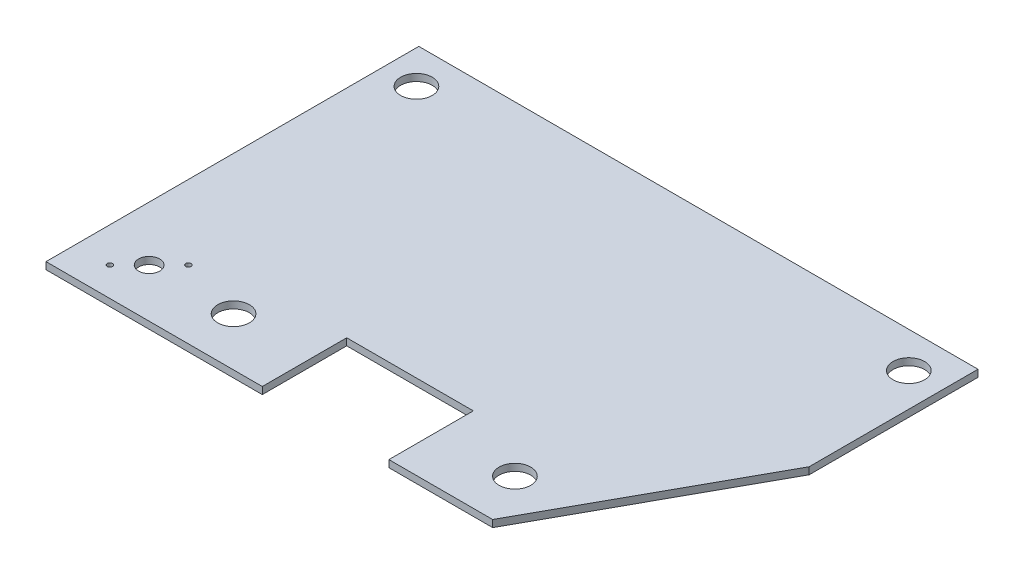
ISO-10303-21;
HEADER;
FILE_DESCRIPTION(('STEP AP214'),'2;1');
FILE_NAME('part.step','',(''),(''),'','','');
FILE_SCHEMA(('AUTOMOTIVE_DESIGN { 1 0 10303 214 1 1 1 1 }'));
ENDSEC;
DATA;
#1=APPLICATION_CONTEXT('core data for automotive mechanical design processes');
#2=APPLICATION_PROTOCOL_DEFINITION('international standard','automotive_design',2000,#1);
#3=PRODUCT_CONTEXT('',#1,'mechanical');
#4=PRODUCT('Part','Part','',(#3));
#5=PRODUCT_RELATED_PRODUCT_CATEGORY('part','',(#4));
#6=PRODUCT_DEFINITION_FORMATION('','',#4);
#7=PRODUCT_DEFINITION_CONTEXT('part definition',#1,'design');
#8=PRODUCT_DEFINITION('design','',#6,#7);
#9=PRODUCT_DEFINITION_SHAPE('','',#8);
#10=(LENGTH_UNIT() NAMED_UNIT(*) SI_UNIT(.MILLI.,.METRE.));
#11=(NAMED_UNIT(*) PLANE_ANGLE_UNIT() SI_UNIT($,.RADIAN.));
#12=(NAMED_UNIT(*) SI_UNIT($,.STERADIAN.) SOLID_ANGLE_UNIT());
#13=UNCERTAINTY_MEASURE_WITH_UNIT(LENGTH_MEASURE(1.E-05),#10,'distance_accuracy_value','');
#14=(GEOMETRIC_REPRESENTATION_CONTEXT(3) GLOBAL_UNCERTAINTY_ASSIGNED_CONTEXT((#13)) GLOBAL_UNIT_ASSIGNED_CONTEXT((#10,
#11,#12)) REPRESENTATION_CONTEXT('',''));
#15=CARTESIAN_POINT('',(0.,0.,0.));
#16=DIRECTION('',(0.,0.,1.));
#17=DIRECTION('',(1.,0.,0.));
#18=AXIS2_PLACEMENT_3D('',#15,#16,#17);
#19=CARTESIAN_POINT('',(-252.4125,3.175,168.275));
#20=DIRECTION('',(0.,0.,-1.));
#21=DIRECTION('',(-1.,0.,0.));
#22=AXIS2_PLACEMENT_3D('',#19,#20,#21);
#23=PLANE('',#22);
#24=DIRECTION('',(1.,0.,0.));
#25=VECTOR('',#24,1.);
#26=CARTESIAN_POINT('',(-252.4125,-3.175,168.275));
#27=LINE('',#26,#25);
#28=CARTESIAN_POINT('',(-252.4125,-3.175,168.275));
#29=VERTEX_POINT('',#28);
#30=CARTESIAN_POINT('',(-57.15,-3.175,168.275));
#31=VERTEX_POINT('',#30);
#32=EDGE_CURVE('E200',#29,#31,#27,.T.);
#33=ORIENTED_EDGE('',*,*,#32,.T.);
#34=DIRECTION('',(0.,1.,0.));
#35=VECTOR('',#34,1.);
#36=CARTESIAN_POINT('',(-57.15,-3.175,168.275));
#37=LINE('',#36,#35);
#38=CARTESIAN_POINT('',(-57.15,3.175,168.275));
#39=VERTEX_POINT('',#38);
#40=EDGE_CURVE('E113',#31,#39,#37,.T.);
#41=ORIENTED_EDGE('',*,*,#40,.T.);
#42=DIRECTION('',(1.,0.,0.));
#43=VECTOR('',#42,1.);
#44=CARTESIAN_POINT('',(-252.4125,3.175,168.275));
#45=LINE('',#44,#43);
#46=CARTESIAN_POINT('',(-252.4125,3.175,168.275));
#47=VERTEX_POINT('',#46);
#48=EDGE_CURVE('E108',#47,#39,#45,.T.);
#49=ORIENTED_EDGE('',*,*,#48,.F.);
#50=DIRECTION('',(0.,-1.,0.));
#51=VECTOR('',#50,1.);
#52=CARTESIAN_POINT('',(-252.4125,3.175,168.275));
#53=LINE('',#52,#51);
#54=EDGE_CURVE('E112',#47,#29,#53,.T.);
#55=ORIENTED_EDGE('',*,*,#54,.T.);
#56=EDGE_LOOP('',(#33,#41,#49,#55));
#57=FACE_BOUND('',#56,.T.);
#58=ADVANCED_FACE('F34',(#57),#23,.F.);
#59=CARTESIAN_POINT('',(252.4125,3.175,168.275));
#60=DIRECTION('',(-1.,0.,0.));
#61=DIRECTION('',(0.,0.,1.));
#62=AXIS2_PLACEMENT_3D('',#59,#60,#61);
#63=PLANE('',#62);
#64=DIRECTION('',(0.,0.,-1.));
#65=VECTOR('',#64,1.);
#66=CARTESIAN_POINT('',(252.4125,3.175,168.275));
#67=LINE('',#66,#65);
#68=CARTESIAN_POINT('',(252.4125,3.175,-15.875));
#69=VERTEX_POINT('',#68);
#70=CARTESIAN_POINT('',(252.4125,3.175,-168.275));
#71=VERTEX_POINT('',#70);
#72=EDGE_CURVE('E198',#69,#71,#67,.T.);
#73=ORIENTED_EDGE('',*,*,#72,.F.);
#74=DIRECTION('',(0.,-1.,0.));
#75=VECTOR('',#74,1.);
#76=CARTESIAN_POINT('',(252.4125,3.175,-15.875));
#77=LINE('',#76,#75);
#78=CARTESIAN_POINT('',(252.4125,-3.175,-15.875));
#79=VERTEX_POINT('',#78);
#80=EDGE_CURVE('E169',#69,#79,#77,.T.);
#81=ORIENTED_EDGE('',*,*,#80,.T.);
#82=DIRECTION('',(0.,0.,-1.));
#83=VECTOR('',#82,1.);
#84=CARTESIAN_POINT('',(252.4125,-3.175,168.275));
#85=LINE('',#84,#83);
#86=CARTESIAN_POINT('',(252.4125,-3.175,-168.275));
#87=VERTEX_POINT('',#86);
#88=EDGE_CURVE('E177',#79,#87,#85,.T.);
#89=ORIENTED_EDGE('',*,*,#88,.T.);
#90=DIRECTION('',(0.,-1.,0.));
#91=VECTOR('',#90,1.);
#92=CARTESIAN_POINT('',(252.4125,3.175,-168.275));
#93=LINE('',#92,#91);
#94=EDGE_CURVE('E11',#71,#87,#93,.T.);
#95=ORIENTED_EDGE('',*,*,#94,.F.);
#96=EDGE_LOOP('',(#73,#81,#89,#95));
#97=FACE_BOUND('',#96,.T.);
#98=ADVANCED_FACE('F36',(#97),#63,.F.);
#99=CARTESIAN_POINT('',(-252.4125,3.175,-168.275));
#100=DIRECTION('',(0.,0.,1.));
#101=DIRECTION('',(1.,0.,0.));
#102=AXIS2_PLACEMENT_3D('',#99,#100,#101);
#103=PLANE('',#102);
#104=DIRECTION('',(-1.,0.,0.));
#105=VECTOR('',#104,1.);
#106=CARTESIAN_POINT('',(-252.4125,-3.175,-168.275));
#107=LINE('',#106,#105);
#108=CARTESIAN_POINT('',(-252.4125,-3.175,-168.275));
#109=VERTEX_POINT('',#108);
#110=EDGE_CURVE('E203',#87,#109,#107,.T.);
#111=ORIENTED_EDGE('',*,*,#110,.T.);
#112=DIRECTION('',(0.,-1.,0.));
#113=VECTOR('',#112,1.);
#114=CARTESIAN_POINT('',(-252.4125,3.175,-168.275));
#115=LINE('',#114,#113);
#116=CARTESIAN_POINT('',(-252.4125,3.175,-168.275));
#117=VERTEX_POINT('',#116);
#118=EDGE_CURVE('E42',#117,#109,#115,.T.);
#119=ORIENTED_EDGE('',*,*,#118,.F.);
#120=DIRECTION('',(-1.,0.,0.));
#121=VECTOR('',#120,1.);
#122=CARTESIAN_POINT('',(-252.4125,3.175,-168.275));
#123=LINE('',#122,#121);
#124=EDGE_CURVE('E123',#71,#117,#123,.T.);
#125=ORIENTED_EDGE('',*,*,#124,.F.);
#126=ORIENTED_EDGE('',*,*,#94,.T.);
#127=EDGE_LOOP('',(#111,#119,#125,#126));
#128=FACE_BOUND('',#127,.T.);
#129=ADVANCED_FACE('F229',(#128),#103,.F.);
#130=CARTESIAN_POINT('',(-252.4125,3.175,168.275));
#131=DIRECTION('',(1.,0.,0.));
#132=DIRECTION('',(0.,0.,-1.));
#133=AXIS2_PLACEMENT_3D('',#130,#131,#132);
#134=PLANE('',#133);
#135=DIRECTION('',(0.,0.,1.));
#136=VECTOR('',#135,1.);
#137=CARTESIAN_POINT('',(-252.4125,-3.175,168.275));
#138=LINE('',#137,#136);
#139=EDGE_CURVE('E131',#109,#29,#138,.T.);
#140=ORIENTED_EDGE('',*,*,#139,.T.);
#141=ORIENTED_EDGE('',*,*,#54,.F.);
#142=DIRECTION('',(0.,0.,1.));
#143=VECTOR('',#142,1.);
#144=CARTESIAN_POINT('',(-252.4125,3.175,168.275));
#145=LINE('',#144,#143);
#146=EDGE_CURVE('E119',#117,#47,#145,.T.);
#147=ORIENTED_EDGE('',*,*,#146,.F.);
#148=ORIENTED_EDGE('',*,*,#118,.T.);
#149=EDGE_LOOP('',(#140,#141,#147,#148));
#150=FACE_BOUND('',#149,.T.);
#151=ADVANCED_FACE('F129',(#150),#134,.F.);
#152=CARTESIAN_POINT('',(57.15,3.175,168.275));
#153=VERTEX_POINT('',#152);
#154=CARTESIAN_POINT('',(150.8125,3.175,168.275));
#155=VERTEX_POINT('',#154);
#156=EDGE_CURVE('E116',#153,#155,#45,.T.);
#157=ORIENTED_EDGE('',*,*,#156,.F.);
#158=DIRECTION('',(0.,1.,0.));
#159=VECTOR('',#158,1.);
#160=CARTESIAN_POINT('',(57.15,-3.175,168.275));
#161=LINE('',#160,#159);
#162=CARTESIAN_POINT('',(57.15,-3.175,168.275));
#163=VERTEX_POINT('',#162);
#164=EDGE_CURVE('E161',#163,#153,#161,.T.);
#165=ORIENTED_EDGE('',*,*,#164,.F.);
#166=CARTESIAN_POINT('',(150.8125,-3.175,168.275));
#167=VERTEX_POINT('',#166);
#168=EDGE_CURVE('E57',#163,#167,#27,.T.);
#169=ORIENTED_EDGE('',*,*,#168,.T.);
#170=DIRECTION('',(0.,-1.,0.));
#171=VECTOR('',#170,1.);
#172=CARTESIAN_POINT('',(150.8125,3.175,168.275));
#173=LINE('',#172,#171);
#174=EDGE_CURVE('E167',#155,#167,#173,.T.);
#175=ORIENTED_EDGE('',*,*,#174,.F.);
#176=EDGE_LOOP('',(#157,#165,#169,#175));
#177=FACE_BOUND('',#176,.T.);
#178=ADVANCED_FACE('F221',(#177),#23,.F.);
#179=CARTESIAN_POINT('',(0.,3.175,0.));
#180=DIRECTION('',(0.,-1.,0.));
#181=DIRECTION('',(0.,0.,-1.));
#182=AXIS2_PLACEMENT_3D('',#179,#180,#181);
#183=PLANE('',#182);
#184=CARTESIAN_POINT('',(-185.4708,3.175,106.645513664432));
#185=DIRECTION('',(0.,1.,0.));
#186=DIRECTION('',(0.,0.,1.));
#187=AXIS2_PLACEMENT_3D('',#184,#185,#186);
#188=CIRCLE('',#187,2.41299999999999);
#189=CARTESIAN_POINT('',(-185.4708,3.175,109.058513664432));
#190=VERTEX_POINT('',#189);
#191=EDGE_CURVE('E296',#190,#190,#188,.T.);
#192=ORIENTED_EDGE('',*,*,#191,.F.);
#193=EDGE_LOOP('',(#192));
#194=FACE_BOUND('',#193,.T.);
#195=CARTESIAN_POINT('',(-222.25,3.175,-135.975286335568));
#196=DIRECTION('',(0.,1.,0.));
#197=DIRECTION('',(0.,0.,1.));
#198=AXIS2_PLACEMENT_3D('',#195,#196,#197);
#199=CIRCLE('',#198,14.2748);
#200=CARTESIAN_POINT('',(-222.25,3.175,-121.700486335568));
#201=VERTEX_POINT('',#200);
#202=EDGE_CURVE('E178',#201,#201,#199,.T.);
#203=ORIENTED_EDGE('',*,*,#202,.F.);
#204=EDGE_LOOP('',(#203));
#205=FACE_BOUND('',#204,.T.);
#206=CARTESIAN_POINT('',(127.,3.175,124.374713664432));
#207=DIRECTION('',(0.,1.,0.));
#208=DIRECTION('',(0.,0.,1.));
#209=AXIS2_PLACEMENT_3D('',#206,#207,#208);
#210=CIRCLE('',#209,14.2748);
#211=CARTESIAN_POINT('',(127.,3.175,138.649513664432));
#212=VERTEX_POINT('',#211);
#213=EDGE_CURVE('E172',#212,#212,#210,.T.);
#214=ORIENTED_EDGE('',*,*,#213,.F.);
#215=EDGE_LOOP('',(#214));
#216=FACE_BOUND('',#215,.T.);
#217=CARTESIAN_POINT('',(-127.,3.175,124.374713664432));
#218=DIRECTION('',(0.,1.,0.));
#219=DIRECTION('',(0.,0.,1.));
#220=AXIS2_PLACEMENT_3D('',#217,#218,#219);
#221=CIRCLE('',#220,14.2748);
#222=CARTESIAN_POINT('',(-127.,3.175,138.649513664432));
#223=VERTEX_POINT('',#222);
#224=EDGE_CURVE('E185',#223,#223,#221,.T.);
#225=ORIENTED_EDGE('',*,*,#224,.F.);
#226=EDGE_LOOP('',(#225));
#227=FACE_BOUND('',#226,.T.);
#228=CARTESIAN_POINT('',(222.25,3.175,-135.975286335568));
#229=DIRECTION('',(0.,1.,0.));
#230=DIRECTION('',(0.,0.,1.));
#231=AXIS2_PLACEMENT_3D('',#228,#229,#230);
#232=CIRCLE('',#231,14.2748000000001);
#233=CARTESIAN_POINT('',(222.25,3.175,-121.700486335568));
#234=VERTEX_POINT('',#233);
#235=EDGE_CURVE('E190',#234,#234,#232,.T.);
#236=ORIENTED_EDGE('',*,*,#235,.F.);
#237=EDGE_LOOP('',(#236));
#238=FACE_BOUND('',#237,.T.);
#239=ORIENTED_EDGE('',*,*,#48,.T.);
#240=DIRECTION('',(0.,0.,1.));
#241=VECTOR('',#240,1.);
#242=CARTESIAN_POINT('',(-57.15,3.175,168.275));
#243=LINE('',#242,#241);
#244=CARTESIAN_POINT('',(-57.15,3.175,92.075));
#245=VERTEX_POINT('',#244);
#246=EDGE_CURVE('E132',#245,#39,#243,.T.);
#247=ORIENTED_EDGE('',*,*,#246,.F.);
#248=DIRECTION('',(-1.,0.,0.));
#249=VECTOR('',#248,1.);
#250=CARTESIAN_POINT('',(-57.15,3.175,92.075));
#251=LINE('',#250,#249);
#252=CARTESIAN_POINT('',(57.15,3.175,92.075));
#253=VERTEX_POINT('',#252);
#254=EDGE_CURVE('E148',#253,#245,#251,.T.);
#255=ORIENTED_EDGE('',*,*,#254,.F.);
#256=DIRECTION('',(0.,0.,-1.));
#257=VECTOR('',#256,1.);
#258=CARTESIAN_POINT('',(57.15,3.175,168.275));
#259=LINE('',#258,#257);
#260=EDGE_CURVE('E135',#153,#253,#259,.T.);
#261=ORIENTED_EDGE('',*,*,#260,.F.);
#262=ORIENTED_EDGE('',*,*,#156,.T.);
#263=DIRECTION('',(0.483077342911335,0.,-0.875577684026794));
#264=VECTOR('',#263,1.);
#265=CARTESIAN_POINT('',(252.4125,3.175,-15.875));
#266=LINE('',#265,#264);
#267=EDGE_CURVE('E164',#155,#69,#266,.T.);
#268=ORIENTED_EDGE('',*,*,#267,.T.);
#269=ORIENTED_EDGE('',*,*,#72,.T.);
#270=ORIENTED_EDGE('',*,*,#124,.T.);
#271=ORIENTED_EDGE('',*,*,#146,.T.);
#272=EDGE_LOOP('',(#239,#247,#255,#261,#262,#268,#269,#270,#271));
#273=FACE_BOUND('',#272,.T.);
#274=CARTESIAN_POINT('',(-220.9292,3.175,142.103913664432));
#275=DIRECTION('',(0.,1.,0.));
#276=DIRECTION('',(0.,0.,1.));
#277=AXIS2_PLACEMENT_3D('',#274,#275,#276);
#278=CIRCLE('',#277,2.413);
#279=CARTESIAN_POINT('',(-220.9292,3.175,144.516913664432));
#280=VERTEX_POINT('',#279);
#281=EDGE_CURVE('E138',#280,#280,#278,.T.);
#282=ORIENTED_EDGE('',*,*,#281,.F.);
#283=EDGE_LOOP('',(#282));
#284=FACE_BOUND('',#283,.T.);
#285=CARTESIAN_POINT('',(-203.2,3.175,124.374713664432));
#286=DIRECTION('',(0.,1.,0.));
#287=DIRECTION('',(0.,0.,1.));
#288=AXIS2_PLACEMENT_3D('',#285,#286,#287);
#289=CIRCLE('',#288,9.525);
#290=CARTESIAN_POINT('',(-203.2,3.175,133.899713664432));
#291=VERTEX_POINT('',#290);
#292=EDGE_CURVE('E133',#291,#291,#289,.T.);
#293=ORIENTED_EDGE('',*,*,#292,.F.);
#294=EDGE_LOOP('',(#293));
#295=FACE_BOUND('',#294,.T.);
#296=ADVANCED_FACE('F120',(#194,#205,#216,#227,#238,#273,#284,#295),#183,.F.);
#297=CARTESIAN_POINT('',(0.,-3.175,0.));
#298=DIRECTION('',(0.,-1.,0.));
#299=DIRECTION('',(0.,0.,-1.));
#300=AXIS2_PLACEMENT_3D('',#297,#298,#299);
#301=PLANE('',#300);
#302=CARTESIAN_POINT('',(-185.4708,-3.175,106.645513664432));
#303=DIRECTION('',(0.,1.,0.));
#304=DIRECTION('',(0.,0.,1.));
#305=AXIS2_PLACEMENT_3D('',#302,#303,#304);
#306=CIRCLE('',#305,2.41299999999999);
#307=CARTESIAN_POINT('',(-185.4708,-3.175,109.058513664432));
#308=VERTEX_POINT('',#307);
#309=EDGE_CURVE('E294',#308,#308,#306,.T.);
#310=ORIENTED_EDGE('',*,*,#309,.T.);
#311=EDGE_LOOP('',(#310));
#312=FACE_BOUND('',#311,.T.);
#313=DIRECTION('',(0.,0.,1.));
#314=VECTOR('',#313,1.);
#315=CARTESIAN_POINT('',(-57.15,-3.175,168.275));
#316=LINE('',#315,#314);
#317=CARTESIAN_POINT('',(-57.15,-3.175,92.075));
#318=VERTEX_POINT('',#317);
#319=EDGE_CURVE('E144',#318,#31,#316,.T.);
#320=ORIENTED_EDGE('',*,*,#319,.T.);
#321=ORIENTED_EDGE('',*,*,#32,.F.);
#322=ORIENTED_EDGE('',*,*,#139,.F.);
#323=ORIENTED_EDGE('',*,*,#110,.F.);
#324=ORIENTED_EDGE('',*,*,#88,.F.);
#325=DIRECTION('',(0.483077342911335,0.,-0.875577684026794));
#326=VECTOR('',#325,1.);
#327=CARTESIAN_POINT('',(252.4125,-3.175,-15.875));
#328=LINE('',#327,#326);
#329=EDGE_CURVE('E158',#167,#79,#328,.T.);
#330=ORIENTED_EDGE('',*,*,#329,.F.);
#331=ORIENTED_EDGE('',*,*,#168,.F.);
#332=DIRECTION('',(0.,0.,-1.));
#333=VECTOR('',#332,1.);
#334=CARTESIAN_POINT('',(57.15,-3.175,168.275));
#335=LINE('',#334,#333);
#336=CARTESIAN_POINT('',(57.15,-3.175,92.075));
#337=VERTEX_POINT('',#336);
#338=EDGE_CURVE('E147',#163,#337,#335,.T.);
#339=ORIENTED_EDGE('',*,*,#338,.T.);
#340=DIRECTION('',(-1.,0.,0.));
#341=VECTOR('',#340,1.);
#342=CARTESIAN_POINT('',(-57.15,-3.175,92.075));
#343=LINE('',#342,#341);
#344=EDGE_CURVE('E49',#337,#318,#343,.T.);
#345=ORIENTED_EDGE('',*,*,#344,.T.);
#346=EDGE_LOOP('',(#320,#321,#322,#323,#324,#330,#331,#339,#345));
#347=FACE_BOUND('',#346,.T.);
#348=CARTESIAN_POINT('',(-222.25,-3.175,-135.975286335568));
#349=DIRECTION('',(0.,1.,0.));
#350=DIRECTION('',(0.,0.,1.));
#351=AXIS2_PLACEMENT_3D('',#348,#349,#350);
#352=CIRCLE('',#351,14.2748);
#353=CARTESIAN_POINT('',(-222.25,-3.175,-121.700486335568));
#354=VERTEX_POINT('',#353);
#355=EDGE_CURVE('E174',#354,#354,#352,.T.);
#356=ORIENTED_EDGE('',*,*,#355,.T.);
#357=EDGE_LOOP('',(#356));
#358=FACE_BOUND('',#357,.T.);
#359=CARTESIAN_POINT('',(127.,-3.175,124.374713664432));
#360=DIRECTION('',(0.,1.,0.));
#361=DIRECTION('',(0.,0.,1.));
#362=AXIS2_PLACEMENT_3D('',#359,#360,#361);
#363=CIRCLE('',#362,14.2748);
#364=CARTESIAN_POINT('',(127.,-3.175,138.649513664432));
#365=VERTEX_POINT('',#364);
#366=EDGE_CURVE('E182',#365,#365,#363,.T.);
#367=ORIENTED_EDGE('',*,*,#366,.T.);
#368=EDGE_LOOP('',(#367));
#369=FACE_BOUND('',#368,.T.);
#370=CARTESIAN_POINT('',(-127.,-3.175,124.374713664432));
#371=DIRECTION('',(0.,1.,0.));
#372=DIRECTION('',(0.,0.,1.));
#373=AXIS2_PLACEMENT_3D('',#370,#371,#372);
#374=CIRCLE('',#373,14.2748);
#375=CARTESIAN_POINT('',(-127.,-3.175,138.649513664432));
#376=VERTEX_POINT('',#375);
#377=EDGE_CURVE('E193',#376,#376,#374,.T.);
#378=ORIENTED_EDGE('',*,*,#377,.T.);
#379=EDGE_LOOP('',(#378));
#380=FACE_BOUND('',#379,.T.);
#381=CARTESIAN_POINT('',(222.25,-3.175,-135.975286335568));
#382=DIRECTION('',(0.,1.,0.));
#383=DIRECTION('',(0.,0.,1.));
#384=AXIS2_PLACEMENT_3D('',#381,#382,#383);
#385=CIRCLE('',#384,14.2748000000001);
#386=CARTESIAN_POINT('',(222.25,-3.175,-121.700486335568));
#387=VERTEX_POINT('',#386);
#388=EDGE_CURVE('E181',#387,#387,#385,.T.);
#389=ORIENTED_EDGE('',*,*,#388,.T.);
#390=EDGE_LOOP('',(#389));
#391=FACE_BOUND('',#390,.T.);
#392=CARTESIAN_POINT('',(-220.9292,-3.175,142.103913664432));
#393=DIRECTION('',(0.,1.,0.));
#394=DIRECTION('',(0.,0.,1.));
#395=AXIS2_PLACEMENT_3D('',#392,#393,#394);
#396=CIRCLE('',#395,2.413);
#397=CARTESIAN_POINT('',(-220.9292,-3.175,144.516913664432));
#398=VERTEX_POINT('',#397);
#399=EDGE_CURVE('E298',#398,#398,#396,.T.);
#400=ORIENTED_EDGE('',*,*,#399,.T.);
#401=EDGE_LOOP('',(#400));
#402=FACE_BOUND('',#401,.T.);
#403=CARTESIAN_POINT('',(-203.2,-3.175,124.374713664432));
#404=DIRECTION('',(0.,1.,0.));
#405=DIRECTION('',(0.,0.,1.));
#406=AXIS2_PLACEMENT_3D('',#403,#404,#405);
#407=CIRCLE('',#406,9.525);
#408=CARTESIAN_POINT('',(-203.2,-3.175,133.899713664432));
#409=VERTEX_POINT('',#408);
#410=EDGE_CURVE('E142',#409,#409,#407,.T.);
#411=ORIENTED_EDGE('',*,*,#410,.T.);
#412=EDGE_LOOP('',(#411));
#413=FACE_BOUND('',#412,.T.);
#414=ADVANCED_FACE('F209',(#312,#347,#358,#369,#380,#391,#402,#413),#301,.T.);
#415=CARTESIAN_POINT('',(222.25,-3.175,-135.975286335568));
#416=DIRECTION('',(0.,1.,0.));
#417=DIRECTION('',(0.,0.,1.));
#418=AXIS2_PLACEMENT_3D('',#415,#416,#417);
#419=CYLINDRICAL_SURFACE('',#418,14.2748000000001);
#420=ORIENTED_EDGE('',*,*,#388,.F.);
#421=EDGE_LOOP('',(#420));
#422=FACE_BOUND('',#421,.T.);
#423=ORIENTED_EDGE('',*,*,#235,.T.);
#424=EDGE_LOOP('',(#423));
#425=FACE_BOUND('',#424,.T.);
#426=ADVANCED_FACE('F250',(#422,#425),#419,.F.);
#427=CARTESIAN_POINT('',(-127.,-3.175,124.374713664432));
#428=DIRECTION('',(0.,1.,0.));
#429=DIRECTION('',(0.,0.,1.));
#430=AXIS2_PLACEMENT_3D('',#427,#428,#429);
#431=CYLINDRICAL_SURFACE('',#430,14.2748);
#432=ORIENTED_EDGE('',*,*,#377,.F.);
#433=EDGE_LOOP('',(#432));
#434=FACE_BOUND('',#433,.T.);
#435=ORIENTED_EDGE('',*,*,#224,.T.);
#436=EDGE_LOOP('',(#435));
#437=FACE_BOUND('',#436,.T.);
#438=ADVANCED_FACE('F255',(#434,#437),#431,.F.);
#439=CARTESIAN_POINT('',(127.,-3.175,124.374713664432));
#440=DIRECTION('',(0.,1.,0.));
#441=DIRECTION('',(0.,0.,1.));
#442=AXIS2_PLACEMENT_3D('',#439,#440,#441);
#443=CYLINDRICAL_SURFACE('',#442,14.2748);
#444=ORIENTED_EDGE('',*,*,#366,.F.);
#445=EDGE_LOOP('',(#444));
#446=FACE_BOUND('',#445,.T.);
#447=ORIENTED_EDGE('',*,*,#213,.T.);
#448=EDGE_LOOP('',(#447));
#449=FACE_BOUND('',#448,.T.);
#450=ADVANCED_FACE('F258',(#446,#449),#443,.F.);
#451=CARTESIAN_POINT('',(-222.25,-3.175,-135.975286335568));
#452=DIRECTION('',(0.,1.,0.));
#453=DIRECTION('',(0.,0.,1.));
#454=AXIS2_PLACEMENT_3D('',#451,#452,#453);
#455=CYLINDRICAL_SURFACE('',#454,14.2748);
#456=ORIENTED_EDGE('',*,*,#355,.F.);
#457=EDGE_LOOP('',(#456));
#458=FACE_BOUND('',#457,.T.);
#459=ORIENTED_EDGE('',*,*,#202,.T.);
#460=EDGE_LOOP('',(#459));
#461=FACE_BOUND('',#460,.T.);
#462=ADVANCED_FACE('F265',(#458,#461),#455,.F.);
#463=CARTESIAN_POINT('',(252.4125,3.175,-15.875));
#464=DIRECTION('',(-0.875577684026794,0.,-0.483077342911335));
#465=DIRECTION('',(-0.483077342911335,0.,0.875577684026794));
#466=AXIS2_PLACEMENT_3D('',#463,#464,#465);
#467=PLANE('',#466);
#468=ORIENTED_EDGE('',*,*,#329,.T.);
#469=ORIENTED_EDGE('',*,*,#80,.F.);
#470=ORIENTED_EDGE('',*,*,#267,.F.);
#471=ORIENTED_EDGE('',*,*,#174,.T.);
#472=EDGE_LOOP('',(#468,#469,#470,#471));
#473=FACE_BOUND('',#472,.T.);
#474=ADVANCED_FACE('F224',(#473),#467,.F.);
#475=CARTESIAN_POINT('',(-57.15,-3.175,168.275));
#476=DIRECTION('',(-1.,0.,0.));
#477=DIRECTION('',(0.,0.,1.));
#478=AXIS2_PLACEMENT_3D('',#475,#476,#477);
#479=PLANE('',#478);
#480=ORIENTED_EDGE('',*,*,#246,.T.);
#481=ORIENTED_EDGE('',*,*,#40,.F.);
#482=ORIENTED_EDGE('',*,*,#319,.F.);
#483=DIRECTION('',(0.,1.,0.));
#484=VECTOR('',#483,1.);
#485=CARTESIAN_POINT('',(-57.15,-3.175,92.075));
#486=LINE('',#485,#484);
#487=EDGE_CURVE('E156',#318,#245,#486,.T.);
#488=ORIENTED_EDGE('',*,*,#487,.T.);
#489=EDGE_LOOP('',(#480,#481,#482,#488));
#490=FACE_BOUND('',#489,.T.);
#491=ADVANCED_FACE('F214',(#490),#479,.F.);
#492=CARTESIAN_POINT('',(-57.15,-3.175,92.075));
#493=DIRECTION('',(0.,0.,-1.));
#494=DIRECTION('',(-1.,0.,0.));
#495=AXIS2_PLACEMENT_3D('',#492,#493,#494);
#496=PLANE('',#495);
#497=ORIENTED_EDGE('',*,*,#254,.T.);
#498=ORIENTED_EDGE('',*,*,#487,.F.);
#499=ORIENTED_EDGE('',*,*,#344,.F.);
#500=DIRECTION('',(0.,1.,0.));
#501=VECTOR('',#500,1.);
#502=CARTESIAN_POINT('',(57.15,-3.175,92.075));
#503=LINE('',#502,#501);
#504=EDGE_CURVE('E159',#337,#253,#503,.T.);
#505=ORIENTED_EDGE('',*,*,#504,.T.);
#506=EDGE_LOOP('',(#497,#498,#499,#505));
#507=FACE_BOUND('',#506,.T.);
#508=ADVANCED_FACE('F218',(#507),#496,.F.);
#509=CARTESIAN_POINT('',(57.15,-3.175,168.275));
#510=DIRECTION('',(1.,0.,0.));
#511=DIRECTION('',(0.,0.,-1.));
#512=AXIS2_PLACEMENT_3D('',#509,#510,#511);
#513=PLANE('',#512);
#514=ORIENTED_EDGE('',*,*,#260,.T.);
#515=ORIENTED_EDGE('',*,*,#504,.F.);
#516=ORIENTED_EDGE('',*,*,#338,.F.);
#517=ORIENTED_EDGE('',*,*,#164,.T.);
#518=EDGE_LOOP('',(#514,#515,#516,#517));
#519=FACE_BOUND('',#518,.T.);
#520=ADVANCED_FACE('F220',(#519),#513,.F.);
#521=CARTESIAN_POINT('',(-220.9292,3.175,142.103913664432));
#522=DIRECTION('',(0.,-1.,0.));
#523=DIRECTION('',(0.,0.,-1.));
#524=AXIS2_PLACEMENT_3D('',#521,#522,#523);
#525=CYLINDRICAL_SURFACE('',#524,2.413);
#526=ORIENTED_EDGE('',*,*,#281,.T.);
#527=EDGE_LOOP('',(#526));
#528=FACE_BOUND('',#527,.T.);
#529=ORIENTED_EDGE('',*,*,#399,.F.);
#530=EDGE_LOOP('',(#529));
#531=FACE_BOUND('',#530,.T.);
#532=ADVANCED_FACE('F276',(#528,#531),#525,.F.);
#533=CARTESIAN_POINT('',(-203.2,3.175,124.374713664432));
#534=DIRECTION('',(0.,-1.,0.));
#535=DIRECTION('',(0.,0.,-1.));
#536=AXIS2_PLACEMENT_3D('',#533,#534,#535);
#537=CYLINDRICAL_SURFACE('',#536,9.525);
#538=ORIENTED_EDGE('',*,*,#292,.T.);
#539=EDGE_LOOP('',(#538));
#540=FACE_BOUND('',#539,.T.);
#541=ORIENTED_EDGE('',*,*,#410,.F.);
#542=EDGE_LOOP('',(#541));
#543=FACE_BOUND('',#542,.T.);
#544=ADVANCED_FACE('F281',(#540,#543),#537,.F.);
#545=CARTESIAN_POINT('',(-185.4708,-3.175,106.645513664432));
#546=DIRECTION('',(0.,1.,0.));
#547=DIRECTION('',(0.,0.,1.));
#548=AXIS2_PLACEMENT_3D('',#545,#546,#547);
#549=CYLINDRICAL_SURFACE('',#548,2.41299999999999);
#550=ORIENTED_EDGE('',*,*,#309,.F.);
#551=EDGE_LOOP('',(#550));
#552=FACE_BOUND('',#551,.T.);
#553=ORIENTED_EDGE('',*,*,#191,.T.);
#554=EDGE_LOOP('',(#553));
#555=FACE_BOUND('',#554,.T.);
#556=ADVANCED_FACE('F285',(#552,#555),#549,.F.);
#557=CLOSED_SHELL('',(#58,#98,#129,#151,#178,#296,#414,#426,#438,#450,#462,#474,#491,#508,#520,
#532,#544,#556));
#558=MANIFOLD_SOLID_BREP('B2',#557);
#559=ADVANCED_BREP_SHAPE_REPRESENTATION('',(#18,#558),#14);
#560=SHAPE_DEFINITION_REPRESENTATION(#9,#559);
ENDSEC;
END-ISO-10303-21;
